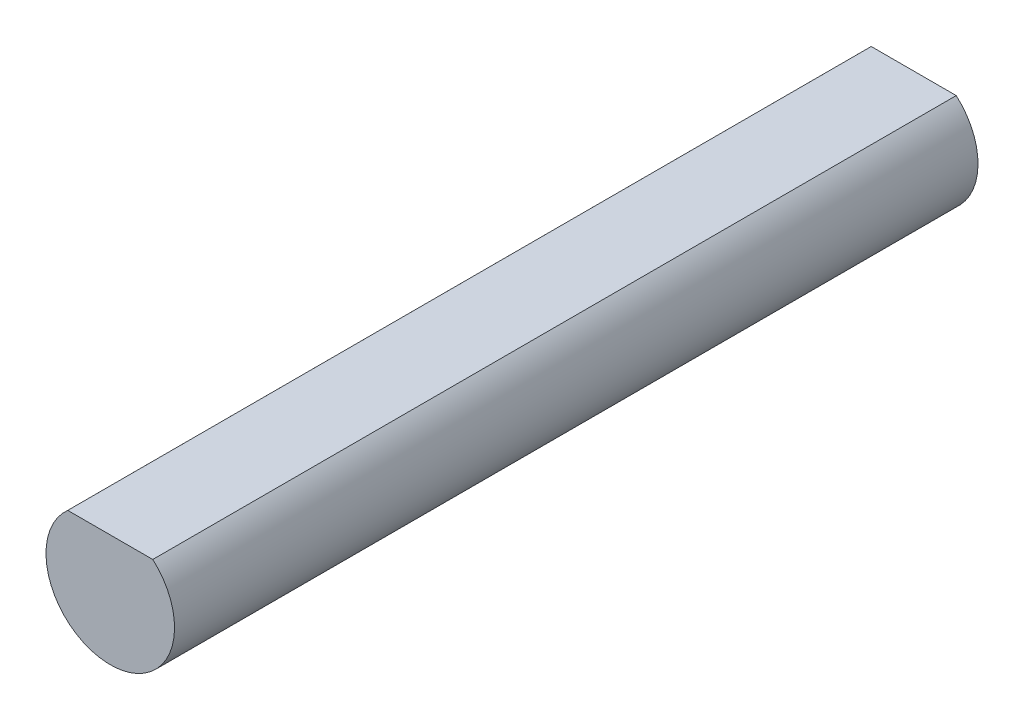
ISO-10303-21;
HEADER;
FILE_DESCRIPTION(('STEP AP214'),'2;1');
FILE_NAME('part.step','',(''),(''),'','','');
FILE_SCHEMA(('AUTOMOTIVE_DESIGN { 1 0 10303 214 1 1 1 1 }'));
ENDSEC;
DATA;
#1=APPLICATION_CONTEXT('core data for automotive mechanical design processes');
#2=APPLICATION_PROTOCOL_DEFINITION('international standard','automotive_design',2000,#1);
#3=PRODUCT_CONTEXT('',#1,'mechanical');
#4=PRODUCT('Part','Part','',(#3));
#5=PRODUCT_RELATED_PRODUCT_CATEGORY('part','',(#4));
#6=PRODUCT_DEFINITION_FORMATION('','',#4);
#7=PRODUCT_DEFINITION_CONTEXT('part definition',#1,'design');
#8=PRODUCT_DEFINITION('design','',#6,#7);
#9=PRODUCT_DEFINITION_SHAPE('','',#8);
#10=(LENGTH_UNIT() NAMED_UNIT(*) SI_UNIT(.MILLI.,.METRE.));
#11=(NAMED_UNIT(*) PLANE_ANGLE_UNIT() SI_UNIT($,.RADIAN.));
#12=(NAMED_UNIT(*) SI_UNIT($,.STERADIAN.) SOLID_ANGLE_UNIT());
#13=UNCERTAINTY_MEASURE_WITH_UNIT(LENGTH_MEASURE(1.E-05),#10,'distance_accuracy_value','');
#14=(GEOMETRIC_REPRESENTATION_CONTEXT(3) GLOBAL_UNCERTAINTY_ASSIGNED_CONTEXT((#13)) GLOBAL_UNIT_ASSIGNED_CONTEXT((#10,
#11,#12)) REPRESENTATION_CONTEXT('',''));
#15=CARTESIAN_POINT('',(0.,0.,0.));
#16=DIRECTION('',(0.,0.,1.));
#17=DIRECTION('',(1.,0.,0.));
#18=AXIS2_PLACEMENT_3D('',#15,#16,#17);
#19=CARTESIAN_POINT('',(0.,0.,25.));
#20=DIRECTION('',(0.,0.,-1.));
#21=DIRECTION('',(-1.,0.,0.));
#22=AXIS2_PLACEMENT_3D('',#19,#20,#21);
#23=CYLINDRICAL_SURFACE('',#22,2.);
#24=CARTESIAN_POINT('',(0.,0.,0.));
#25=DIRECTION('',(0.,0.,1.));
#26=DIRECTION('',(1.,0.,0.));
#27=AXIS2_PLACEMENT_3D('',#24,#25,#26);
#28=CIRCLE('',#27,2.);
#29=CARTESIAN_POINT('',(-1.3228756555323,1.5,0.));
#30=VERTEX_POINT('',#29);
#31=CARTESIAN_POINT('',(1.3228756555323,1.5,0.));
#32=VERTEX_POINT('',#31);
#33=EDGE_CURVE('E72',#30,#32,#28,.T.);
#34=ORIENTED_EDGE('',*,*,#33,.T.);
#35=DIRECTION('',(0.,0.,-1.));
#36=VECTOR('',#35,1.);
#37=CARTESIAN_POINT('',(1.3228756555323,1.5,25.));
#38=LINE('',#37,#36);
#39=CARTESIAN_POINT('',(1.3228756555323,1.5,25.));
#40=VERTEX_POINT('',#39);
#41=EDGE_CURVE('E11',#40,#32,#38,.T.);
#42=ORIENTED_EDGE('',*,*,#41,.F.);
#43=CARTESIAN_POINT('',(0.,0.,25.));
#44=DIRECTION('',(0.,0.,1.));
#45=DIRECTION('',(1.,0.,0.));
#46=AXIS2_PLACEMENT_3D('',#43,#44,#45);
#47=CIRCLE('',#46,2.);
#48=CARTESIAN_POINT('',(-1.3228756555323,1.5,25.));
#49=VERTEX_POINT('',#48);
#50=EDGE_CURVE('E71',#49,#40,#47,.T.);
#51=ORIENTED_EDGE('',*,*,#50,.F.);
#52=DIRECTION('',(0.,0.,-1.));
#53=VECTOR('',#52,1.);
#54=CARTESIAN_POINT('',(-1.3228756555323,1.5,25.));
#55=LINE('',#54,#53);
#56=EDGE_CURVE('E48',#49,#30,#55,.T.);
#57=ORIENTED_EDGE('',*,*,#56,.T.);
#58=EDGE_LOOP('',(#34,#42,#51,#57));
#59=FACE_BOUND('',#58,.T.);
#60=ADVANCED_FACE('F39',(#59),#23,.T.);
#61=CARTESIAN_POINT('',(-1.3228756555323,1.5,25.));
#62=DIRECTION('',(0.,-1.,0.));
#63=DIRECTION('',(0.,0.,-1.));
#64=AXIS2_PLACEMENT_3D('',#61,#62,#63);
#65=PLANE('',#64);
#66=DIRECTION('',(-1.,0.,0.));
#67=VECTOR('',#66,1.);
#68=CARTESIAN_POINT('',(-1.3228756555323,1.5,0.));
#69=LINE('',#68,#67);
#70=EDGE_CURVE('E63',#32,#30,#69,.T.);
#71=ORIENTED_EDGE('',*,*,#70,.T.);
#72=ORIENTED_EDGE('',*,*,#56,.F.);
#73=DIRECTION('',(-1.,0.,0.));
#74=VECTOR('',#73,1.);
#75=CARTESIAN_POINT('',(-1.3228756555323,1.5,25.));
#76=LINE('',#75,#74);
#77=EDGE_CURVE('E55',#40,#49,#76,.T.);
#78=ORIENTED_EDGE('',*,*,#77,.F.);
#79=ORIENTED_EDGE('',*,*,#41,.T.);
#80=EDGE_LOOP('',(#71,#72,#78,#79));
#81=FACE_BOUND('',#80,.T.);
#82=ADVANCED_FACE('F66',(#81),#65,.F.);
#83=CARTESIAN_POINT('',(0.,0.,25.));
#84=DIRECTION('',(0.,0.,1.));
#85=DIRECTION('',(1.,0.,0.));
#86=AXIS2_PLACEMENT_3D('',#83,#84,#85);
#87=PLANE('',#86);
#88=ORIENTED_EDGE('',*,*,#50,.T.);
#89=ORIENTED_EDGE('',*,*,#77,.T.);
#90=EDGE_LOOP('',(#88,#89));
#91=FACE_BOUND('',#90,.T.);
#92=ADVANCED_FACE('F83',(#91),#87,.T.);
#93=CARTESIAN_POINT('',(0.,0.,0.));
#94=DIRECTION('',(0.,0.,1.));
#95=DIRECTION('',(1.,0.,0.));
#96=AXIS2_PLACEMENT_3D('',#93,#94,#95);
#97=PLANE('',#96);
#98=ORIENTED_EDGE('',*,*,#33,.F.);
#99=ORIENTED_EDGE('',*,*,#70,.F.);
#100=EDGE_LOOP('',(#98,#99));
#101=FACE_BOUND('',#100,.T.);
#102=ADVANCED_FACE('F76',(#101),#97,.F.);
#103=CLOSED_SHELL('',(#60,#82,#92,#102));
#104=MANIFOLD_SOLID_BREP('B2',#103);
#105=ADVANCED_BREP_SHAPE_REPRESENTATION('',(#18,#104),#14);
#106=SHAPE_DEFINITION_REPRESENTATION(#9,#105);
ENDSEC;
END-ISO-10303-21;
